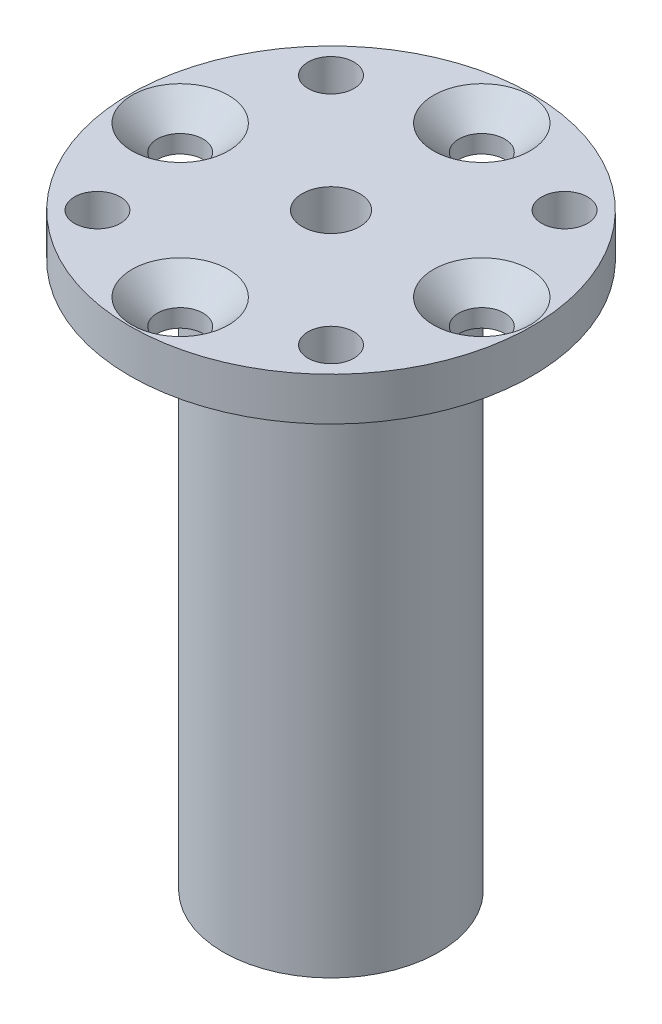
ISO-10303-21;
HEADER;
FILE_DESCRIPTION(('STEP AP214'),'2;1');
FILE_NAME('part.step','',(''),(''),'','','');
FILE_SCHEMA(('AUTOMOTIVE_DESIGN { 1 0 10303 214 1 1 1 1 }'));
ENDSEC;
DATA;
#1=APPLICATION_CONTEXT('core data for automotive mechanical design processes');
#2=APPLICATION_PROTOCOL_DEFINITION('international standard','automotive_design',2000,#1);
#3=PRODUCT_CONTEXT('',#1,'mechanical');
#4=PRODUCT('Part','Part','',(#3));
#5=PRODUCT_RELATED_PRODUCT_CATEGORY('part','',(#4));
#6=PRODUCT_DEFINITION_FORMATION('','',#4);
#7=PRODUCT_DEFINITION_CONTEXT('part definition',#1,'design');
#8=PRODUCT_DEFINITION('design','',#6,#7);
#9=PRODUCT_DEFINITION_SHAPE('','',#8);
#10=(LENGTH_UNIT() NAMED_UNIT(*) SI_UNIT(.MILLI.,.METRE.));
#11=(NAMED_UNIT(*) PLANE_ANGLE_UNIT() SI_UNIT($,.RADIAN.));
#12=(NAMED_UNIT(*) SI_UNIT($,.STERADIAN.) SOLID_ANGLE_UNIT());
#13=UNCERTAINTY_MEASURE_WITH_UNIT(LENGTH_MEASURE(1.E-05),#10,'distance_accuracy_value','');
#14=(GEOMETRIC_REPRESENTATION_CONTEXT(3) GLOBAL_UNCERTAINTY_ASSIGNED_CONTEXT((#13)) GLOBAL_UNIT_ASSIGNED_CONTEXT((#10,
#11,#12)) REPRESENTATION_CONTEXT('',''));
#15=CARTESIAN_POINT('',(0.,0.,0.));
#16=DIRECTION('',(0.,0.,1.));
#17=DIRECTION('',(1.,0.,0.));
#18=AXIS2_PLACEMENT_3D('',#15,#16,#17);
#19=CARTESIAN_POINT('',(0.,0.,0.));
#20=DIRECTION('',(0.,-1.,0.));
#21=DIRECTION('',(0.,0.,-1.));
#22=AXIS2_PLACEMENT_3D('',#19,#20,#21);
#23=PLANE('',#22);
#24=CARTESIAN_POINT('',(8.13172798364517,0.,-8.13172798364543));
#25=DIRECTION('',(0.,1.,0.));
#26=DIRECTION('',(0.,0.,1.));
#27=AXIS2_PLACEMENT_3D('',#24,#25,#26);
#28=CIRCLE('',#27,1.6);
#29=CARTESIAN_POINT('',(8.13172798364517,0.,-6.53172798364543));
#30=VERTEX_POINT('',#29);
#31=EDGE_CURVE('E145',#30,#30,#28,.T.);
#32=ORIENTED_EDGE('',*,*,#31,.F.);
#33=EDGE_LOOP('',(#32));
#34=FACE_BOUND('',#33,.T.);
#35=CARTESIAN_POINT('',(8.13172798364534,0.,8.13172798364525));
#36=DIRECTION('',(0.,1.,0.));
#37=DIRECTION('',(0.,0.,1.));
#38=AXIS2_PLACEMENT_3D('',#35,#36,#37);
#39=CIRCLE('',#38,1.6);
#40=CARTESIAN_POINT('',(8.13172798364534,0.,9.73172798364525));
#41=VERTEX_POINT('',#40);
#42=EDGE_CURVE('E149',#41,#41,#39,.T.);
#43=ORIENTED_EDGE('',*,*,#42,.F.);
#44=EDGE_LOOP('',(#43));
#45=FACE_BOUND('',#44,.T.);
#46=CARTESIAN_POINT('',(-8.13172798364534,0.,-8.13172798364525));
#47=DIRECTION('',(0.,1.,0.));
#48=DIRECTION('',(0.,0.,1.));
#49=AXIS2_PLACEMENT_3D('',#46,#47,#48);
#50=CIRCLE('',#49,1.6);
#51=CARTESIAN_POINT('',(-8.13172798364534,0.,-6.53172798364525));
#52=VERTEX_POINT('',#51);
#53=EDGE_CURVE('E153',#52,#52,#50,.T.);
#54=ORIENTED_EDGE('',*,*,#53,.F.);
#55=EDGE_LOOP('',(#54));
#56=FACE_BOUND('',#55,.T.);
#57=CARTESIAN_POINT('',(10.5,0.,-1.09981662173559E-13));
#58=DIRECTION('',(0.,1.,0.));
#59=DIRECTION('',(0.,0.,1.));
#60=AXIS2_PLACEMENT_3D('',#57,#58,#59);
#61=CIRCLE('',#60,3.36);
#62=CARTESIAN_POINT('',(10.5,0.,3.35999999999989));
#63=VERTEX_POINT('',#62);
#64=EDGE_CURVE('E157',#63,#63,#61,.T.);
#65=ORIENTED_EDGE('',*,*,#64,.F.);
#66=EDGE_LOOP('',(#65));
#67=FACE_BOUND('',#66,.T.);
#68=CARTESIAN_POINT('',(0.,0.,10.5));
#69=DIRECTION('',(0.,1.,0.));
#70=DIRECTION('',(0.,0.,1.));
#71=AXIS2_PLACEMENT_3D('',#68,#69,#70);
#72=CIRCLE('',#71,3.36);
#73=CARTESIAN_POINT('',(0.,0.,13.86));
#74=VERTEX_POINT('',#73);
#75=EDGE_CURVE('E161',#74,#74,#72,.T.);
#76=ORIENTED_EDGE('',*,*,#75,.F.);
#77=EDGE_LOOP('',(#76));
#78=FACE_BOUND('',#77,.T.);
#79=CARTESIAN_POINT('',(-10.5,0.,0.));
#80=DIRECTION('',(0.,1.,0.));
#81=DIRECTION('',(0.,0.,1.));
#82=AXIS2_PLACEMENT_3D('',#79,#80,#81);
#83=CIRCLE('',#82,3.36);
#84=CARTESIAN_POINT('',(-10.5,0.,3.36000000000004));
#85=VERTEX_POINT('',#84);
#86=EDGE_CURVE('E165',#85,#85,#83,.T.);
#87=ORIENTED_EDGE('',*,*,#86,.F.);
#88=EDGE_LOOP('',(#87));
#89=FACE_BOUND('',#88,.T.);
#90=CARTESIAN_POINT('',(0.,0.,-10.5));
#91=DIRECTION('',(0.,1.,0.));
#92=DIRECTION('',(0.,0.,1.));
#93=AXIS2_PLACEMENT_3D('',#90,#91,#92);
#94=CIRCLE('',#93,3.36);
#95=CARTESIAN_POINT('',(0.,0.,-7.14));
#96=VERTEX_POINT('',#95);
#97=EDGE_CURVE('E169',#96,#96,#94,.T.);
#98=ORIENTED_EDGE('',*,*,#97,.F.);
#99=EDGE_LOOP('',(#98));
#100=FACE_BOUND('',#99,.T.);
#101=CARTESIAN_POINT('',(0.,0.,0.));
#102=DIRECTION('',(0.,1.,0.));
#103=DIRECTION('',(0.,0.,1.));
#104=AXIS2_PLACEMENT_3D('',#101,#102,#103);
#105=CIRCLE('',#104,1.99999999999999);
#106=CARTESIAN_POINT('',(0.,0.,1.99999999999999));
#107=VERTEX_POINT('',#106);
#108=EDGE_CURVE('E94',#107,#107,#105,.T.);
#109=ORIENTED_EDGE('',*,*,#108,.F.);
#110=EDGE_LOOP('',(#109));
#111=FACE_BOUND('',#110,.T.);
#112=CARTESIAN_POINT('',(0.,0.,0.));
#113=DIRECTION('',(0.,1.,0.));
#114=DIRECTION('',(0.,0.,1.));
#115=AXIS2_PLACEMENT_3D('',#112,#113,#114);
#116=CIRCLE('',#115,14.);
#117=CARTESIAN_POINT('',(0.,0.,14.));
#118=VERTEX_POINT('',#117);
#119=EDGE_CURVE('E13',#118,#118,#116,.T.);
#120=ORIENTED_EDGE('',*,*,#119,.T.);
#121=EDGE_LOOP('',(#120));
#122=FACE_BOUND('',#121,.T.);
#123=CARTESIAN_POINT('',(-8.13172798364522,0.,8.13172798364537));
#124=DIRECTION('',(0.,1.,0.));
#125=DIRECTION('',(0.,0.,1.));
#126=AXIS2_PLACEMENT_3D('',#123,#124,#125);
#127=CIRCLE('',#126,1.6);
#128=CARTESIAN_POINT('',(-8.13172798364522,0.,9.73172798364537));
#129=VERTEX_POINT('',#128);
#130=EDGE_CURVE('E176',#129,#129,#127,.T.);
#131=ORIENTED_EDGE('',*,*,#130,.F.);
#132=EDGE_LOOP('',(#131));
#133=FACE_BOUND('',#132,.T.);
#134=ADVANCED_FACE('F48',(#34,#45,#56,#67,#78,#89,#100,#111,#122,#133),#23,.F.);
#135=CARTESIAN_POINT('',(0.,9.41489361702128,0.));
#136=DIRECTION('',(0.,1.,0.));
#137=DIRECTION('',(0.,0.,1.));
#138=AXIS2_PLACEMENT_3D('',#135,#136,#137);
#139=CYLINDRICAL_SURFACE('',#138,14.);
#140=ORIENTED_EDGE('',*,*,#119,.F.);
#141=EDGE_LOOP('',(#140));
#142=FACE_BOUND('',#141,.T.);
#143=CARTESIAN_POINT('',(0.,-3.,0.));
#144=DIRECTION('',(0.,1.,0.));
#145=DIRECTION('',(0.,0.,1.));
#146=AXIS2_PLACEMENT_3D('',#143,#144,#145);
#147=CIRCLE('',#146,14.);
#148=CARTESIAN_POINT('',(0.,-3.,14.));
#149=VERTEX_POINT('',#148);
#150=EDGE_CURVE('E55',#149,#149,#147,.T.);
#151=ORIENTED_EDGE('',*,*,#150,.T.);
#152=EDGE_LOOP('',(#151));
#153=FACE_BOUND('',#152,.T.);
#154=ADVANCED_FACE('F108',(#142,#153),#139,.T.);
#155=CARTESIAN_POINT('',(14.,-3.,0.));
#156=DIRECTION('',(0.,1.,0.));
#157=DIRECTION('',(0.,0.,1.));
#158=AXIS2_PLACEMENT_3D('',#155,#156,#157);
#159=PLANE('',#158);
#160=CARTESIAN_POINT('',(8.13172798364517,-3.,-8.13172798364543));
#161=DIRECTION('',(0.,1.,0.));
#162=DIRECTION('',(0.,0.,1.));
#163=AXIS2_PLACEMENT_3D('',#160,#161,#162);
#164=CIRCLE('',#163,1.6);
#165=CARTESIAN_POINT('',(8.13172798364517,-3.,-6.53172798364543));
#166=VERTEX_POINT('',#165);
#167=EDGE_CURVE('E430',#166,#166,#164,.T.);
#168=ORIENTED_EDGE('',*,*,#167,.T.);
#169=EDGE_LOOP('',(#168));
#170=FACE_BOUND('',#169,.T.);
#171=CARTESIAN_POINT('',(8.13172798364534,-3.,8.13172798364525));
#172=DIRECTION('',(0.,1.,0.));
#173=DIRECTION('',(0.,0.,1.));
#174=AXIS2_PLACEMENT_3D('',#171,#172,#173);
#175=CIRCLE('',#174,1.6);
#176=CARTESIAN_POINT('',(8.13172798364534,-3.,9.73172798364525));
#177=VERTEX_POINT('',#176);
#178=EDGE_CURVE('E179',#177,#177,#175,.T.);
#179=ORIENTED_EDGE('',*,*,#178,.T.);
#180=EDGE_LOOP('',(#179));
#181=FACE_BOUND('',#180,.T.);
#182=CARTESIAN_POINT('',(-8.13172798364522,-3.,8.13172798364537));
#183=DIRECTION('',(0.,1.,0.));
#184=DIRECTION('',(0.,0.,1.));
#185=AXIS2_PLACEMENT_3D('',#182,#183,#184);
#186=CIRCLE('',#185,1.6);
#187=CARTESIAN_POINT('',(-8.13172798364522,-3.,9.73172798364537));
#188=VERTEX_POINT('',#187);
#189=EDGE_CURVE('E178',#188,#188,#186,.T.);
#190=ORIENTED_EDGE('',*,*,#189,.T.);
#191=EDGE_LOOP('',(#190));
#192=FACE_BOUND('',#191,.T.);
#193=CARTESIAN_POINT('',(-8.13172798364534,-3.,-8.13172798364525));
#194=DIRECTION('',(0.,1.,0.));
#195=DIRECTION('',(0.,0.,1.));
#196=AXIS2_PLACEMENT_3D('',#193,#194,#195);
#197=CIRCLE('',#196,1.6);
#198=CARTESIAN_POINT('',(-8.13172798364534,-3.,-6.53172798364525));
#199=VERTEX_POINT('',#198);
#200=EDGE_CURVE('E188',#199,#199,#197,.T.);
#201=ORIENTED_EDGE('',*,*,#200,.T.);
#202=EDGE_LOOP('',(#201));
#203=FACE_BOUND('',#202,.T.);
#204=CARTESIAN_POINT('',(10.5,-3.,-1.09981662173559E-13));
#205=DIRECTION('',(0.,1.,0.));
#206=DIRECTION('',(0.,0.,1.));
#207=AXIS2_PLACEMENT_3D('',#204,#205,#206);
#208=CIRCLE('',#207,1.6);
#209=CARTESIAN_POINT('',(10.5,-3.,1.59999999999989));
#210=VERTEX_POINT('',#209);
#211=EDGE_CURVE('E195',#210,#210,#208,.T.);
#212=ORIENTED_EDGE('',*,*,#211,.T.);
#213=EDGE_LOOP('',(#212));
#214=FACE_BOUND('',#213,.T.);
#215=CARTESIAN_POINT('',(0.,-3.,10.5));
#216=DIRECTION('',(0.,1.,0.));
#217=DIRECTION('',(0.,0.,1.));
#218=AXIS2_PLACEMENT_3D('',#215,#216,#217);
#219=CIRCLE('',#218,1.6);
#220=CARTESIAN_POINT('',(0.,-3.,12.1));
#221=VERTEX_POINT('',#220);
#222=EDGE_CURVE('E202',#221,#221,#219,.T.);
#223=ORIENTED_EDGE('',*,*,#222,.T.);
#224=EDGE_LOOP('',(#223));
#225=FACE_BOUND('',#224,.T.);
#226=CARTESIAN_POINT('',(-10.5,-3.,0.));
#227=DIRECTION('',(0.,1.,0.));
#228=DIRECTION('',(0.,0.,1.));
#229=AXIS2_PLACEMENT_3D('',#226,#227,#228);
#230=CIRCLE('',#229,1.6);
#231=CARTESIAN_POINT('',(-10.5,-3.,1.60000000000003));
#232=VERTEX_POINT('',#231);
#233=EDGE_CURVE('E209',#232,#232,#230,.T.);
#234=ORIENTED_EDGE('',*,*,#233,.T.);
#235=EDGE_LOOP('',(#234));
#236=FACE_BOUND('',#235,.T.);
#237=CARTESIAN_POINT('',(0.,-3.,-10.5));
#238=DIRECTION('',(0.,1.,0.));
#239=DIRECTION('',(0.,0.,1.));
#240=AXIS2_PLACEMENT_3D('',#237,#238,#239);
#241=CIRCLE('',#240,1.6);
#242=CARTESIAN_POINT('',(0.,-3.,-8.9));
#243=VERTEX_POINT('',#242);
#244=EDGE_CURVE('E82',#243,#243,#241,.T.);
#245=ORIENTED_EDGE('',*,*,#244,.T.);
#246=EDGE_LOOP('',(#245));
#247=FACE_BOUND('',#246,.T.);
#248=ORIENTED_EDGE('',*,*,#150,.F.);
#249=EDGE_LOOP('',(#248));
#250=FACE_BOUND('',#249,.T.);
#251=CARTESIAN_POINT('',(0.,-3.,0.));
#252=DIRECTION('',(0.,1.,0.));
#253=DIRECTION('',(0.,0.,1.));
#254=AXIS2_PLACEMENT_3D('',#251,#252,#253);
#255=CIRCLE('',#254,7.5);
#256=CARTESIAN_POINT('',(0.,-3.,7.5));
#257=VERTEX_POINT('',#256);
#258=EDGE_CURVE('E103',#257,#257,#255,.T.);
#259=ORIENTED_EDGE('',*,*,#258,.T.);
#260=EDGE_LOOP('',(#259));
#261=FACE_BOUND('',#260,.T.);
#262=ADVANCED_FACE('F110',(#170,#181,#192,#203,#214,#225,#236,#247,#250,#261),#159,.F.);
#263=CARTESIAN_POINT('',(0.,9.41489361702128,0.));
#264=DIRECTION('',(0.,1.,0.));
#265=DIRECTION('',(0.,0.,1.));
#266=AXIS2_PLACEMENT_3D('',#263,#264,#265);
#267=CYLINDRICAL_SURFACE('',#266,7.5);
#268=ORIENTED_EDGE('',*,*,#258,.F.);
#269=EDGE_LOOP('',(#268));
#270=FACE_BOUND('',#269,.T.);
#271=CARTESIAN_POINT('',(0.,-41.,0.));
#272=DIRECTION('',(0.,1.,0.));
#273=DIRECTION('',(0.,0.,1.));
#274=AXIS2_PLACEMENT_3D('',#271,#272,#273);
#275=CIRCLE('',#274,7.50000000000001);
#276=CARTESIAN_POINT('',(0.,-41.,7.50000000000001));
#277=VERTEX_POINT('',#276);
#278=EDGE_CURVE('E100',#277,#277,#275,.T.);
#279=ORIENTED_EDGE('',*,*,#278,.T.);
#280=EDGE_LOOP('',(#279));
#281=FACE_BOUND('',#280,.T.);
#282=ADVANCED_FACE('F113',(#270,#281),#267,.T.);
#283=CARTESIAN_POINT('',(7.50000000000001,-41.,0.));
#284=DIRECTION('',(0.,1.,0.));
#285=DIRECTION('',(0.,0.,1.));
#286=AXIS2_PLACEMENT_3D('',#283,#284,#285);
#287=PLANE('',#286);
#288=CARTESIAN_POINT('',(-2.74999999999996,-41.,4.76313972081444));
#289=DIRECTION('',(0.,-1.,0.));
#290=DIRECTION('',(0.,0.,-1.));
#291=AXIS2_PLACEMENT_3D('',#288,#289,#290);
#292=CIRCLE('',#291,1.24999999999999);
#293=CARTESIAN_POINT('',(-2.74999999999996,-41.,3.51313972081445));
#294=VERTEX_POINT('',#293);
#295=EDGE_CURVE('E76',#294,#294,#292,.T.);
#296=ORIENTED_EDGE('',*,*,#295,.F.);
#297=EDGE_LOOP('',(#296));
#298=FACE_BOUND('',#297,.T.);
#299=CARTESIAN_POINT('',(-2.75000000000002,-41.,-4.7631397208144));
#300=DIRECTION('',(0.,-1.,0.));
#301=DIRECTION('',(0.,0.,-1.));
#302=AXIS2_PLACEMENT_3D('',#299,#300,#301);
#303=CIRCLE('',#302,1.24999999999999);
#304=CARTESIAN_POINT('',(-2.75000000000002,-41.,-6.01313972081439));
#305=VERTEX_POINT('',#304);
#306=EDGE_CURVE('E75',#305,#305,#303,.T.);
#307=ORIENTED_EDGE('',*,*,#306,.F.);
#308=EDGE_LOOP('',(#307));
#309=FACE_BOUND('',#308,.T.);
#310=CARTESIAN_POINT('',(5.5,-41.,0.));
#311=DIRECTION('',(0.,-1.,0.));
#312=DIRECTION('',(0.,0.,-1.));
#313=AXIS2_PLACEMENT_3D('',#310,#311,#312);
#314=CIRCLE('',#313,1.24999999999999);
#315=CARTESIAN_POINT('',(5.5,-41.,-1.24999999999999));
#316=VERTEX_POINT('',#315);
#317=EDGE_CURVE('E88',#316,#316,#314,.T.);
#318=ORIENTED_EDGE('',*,*,#317,.F.);
#319=EDGE_LOOP('',(#318));
#320=FACE_BOUND('',#319,.T.);
#321=CARTESIAN_POINT('',(0.,-41.,0.));
#322=DIRECTION('',(0.,1.,0.));
#323=DIRECTION('',(0.,0.,1.));
#324=AXIS2_PLACEMENT_3D('',#321,#322,#323);
#325=CIRCLE('',#324,1.99999999999999);
#326=CARTESIAN_POINT('',(0.,-41.,1.99999999999999));
#327=VERTEX_POINT('',#326);
#328=EDGE_CURVE('E97',#327,#327,#325,.T.);
#329=ORIENTED_EDGE('',*,*,#328,.T.);
#330=EDGE_LOOP('',(#329));
#331=FACE_BOUND('',#330,.T.);
#332=ORIENTED_EDGE('',*,*,#278,.F.);
#333=EDGE_LOOP('',(#332));
#334=FACE_BOUND('',#333,.T.);
#335=ADVANCED_FACE('F120',(#298,#309,#320,#331,#334),#287,.F.);
#336=CARTESIAN_POINT('',(0.,0.,0.));
#337=DIRECTION('',(0.,1.,0.));
#338=DIRECTION('',(0.,0.,1.));
#339=AXIS2_PLACEMENT_3D('',#336,#337,#338);
#340=CYLINDRICAL_SURFACE('',#339,1.99999999999999);
#341=ORIENTED_EDGE('',*,*,#328,.F.);
#342=EDGE_LOOP('',(#341));
#343=FACE_BOUND('',#342,.T.);
#344=ORIENTED_EDGE('',*,*,#108,.T.);
#345=EDGE_LOOP('',(#344));
#346=FACE_BOUND('',#345,.T.);
#347=ADVANCED_FACE('F125',(#343,#346),#340,.F.);
#348=CARTESIAN_POINT('',(5.5,-29.,0.));
#349=DIRECTION('',(0.,-1.,0.));
#350=DIRECTION('',(0.,0.,-1.));
#351=AXIS2_PLACEMENT_3D('',#348,#349,#350);
#352=CONICAL_SURFACE('',#351,1.24999999999999,1.02974425867665);
#353=CARTESIAN_POINT('',(5.5,-28.2489242262156,0.));
#354=VERTEX_POINT('',#353);
#355=VERTEX_LOOP('',#354);
#356=FACE_BOUND('',#355,.T.);
#357=CARTESIAN_POINT('',(5.5,-29.,0.));
#358=DIRECTION('',(0.,-1.,0.));
#359=DIRECTION('',(0.,0.,-1.));
#360=AXIS2_PLACEMENT_3D('',#357,#358,#359);
#361=CIRCLE('',#360,1.24999999999999);
#362=CARTESIAN_POINT('',(5.5,-29.,-1.24999999999999));
#363=VERTEX_POINT('',#362);
#364=EDGE_CURVE('E91',#363,#363,#361,.T.);
#365=ORIENTED_EDGE('',*,*,#364,.T.);
#366=EDGE_LOOP('',(#365));
#367=FACE_BOUND('',#366,.T.);
#368=ADVANCED_FACE('F131',(#356,#367),#352,.F.);
#369=CARTESIAN_POINT('',(5.5,-41.,0.));
#370=DIRECTION('',(0.,-1.,0.));
#371=DIRECTION('',(0.,0.,-1.));
#372=AXIS2_PLACEMENT_3D('',#369,#370,#371);
#373=CYLINDRICAL_SURFACE('',#372,1.24999999999999);
#374=ORIENTED_EDGE('',*,*,#364,.F.);
#375=EDGE_LOOP('',(#374));
#376=FACE_BOUND('',#375,.T.);
#377=ORIENTED_EDGE('',*,*,#317,.T.);
#378=EDGE_LOOP('',(#377));
#379=FACE_BOUND('',#378,.T.);
#380=ADVANCED_FACE('F246',(#376,#379),#373,.F.);
#381=CARTESIAN_POINT('',(-2.75000000000002,-29.,-4.7631397208144));
#382=DIRECTION('',(0.,-1.,0.));
#383=DIRECTION('',(0.,0.,-1.));
#384=AXIS2_PLACEMENT_3D('',#381,#382,#383);
#385=CONICAL_SURFACE('',#384,1.24999999999999,1.02974425867665);
#386=CARTESIAN_POINT('',(-2.75000000000003,-28.2489242262156,-4.7631397208144));
#387=VERTEX_POINT('',#386);
#388=VERTEX_LOOP('',#387);
#389=FACE_BOUND('',#388,.T.);
#390=CARTESIAN_POINT('',(-2.75000000000002,-29.,-4.7631397208144));
#391=DIRECTION('',(0.,-1.,0.));
#392=DIRECTION('',(0.,0.,-1.));
#393=AXIS2_PLACEMENT_3D('',#390,#391,#392);
#394=CIRCLE('',#393,1.24999999999999);
#395=CARTESIAN_POINT('',(-2.75000000000002,-29.,-6.01313972081439));
#396=VERTEX_POINT('',#395);
#397=EDGE_CURVE('E79',#396,#396,#394,.T.);
#398=ORIENTED_EDGE('',*,*,#397,.T.);
#399=EDGE_LOOP('',(#398));
#400=FACE_BOUND('',#399,.T.);
#401=ADVANCED_FACE('F242',(#389,#400),#385,.F.);
#402=CARTESIAN_POINT('',(-2.75000000000002,-41.,-4.7631397208144));
#403=DIRECTION('',(0.,-1.,0.));
#404=DIRECTION('',(0.,0.,-1.));
#405=AXIS2_PLACEMENT_3D('',#402,#403,#404);
#406=CYLINDRICAL_SURFACE('',#405,1.24999999999999);
#407=ORIENTED_EDGE('',*,*,#397,.F.);
#408=EDGE_LOOP('',(#407));
#409=FACE_BOUND('',#408,.T.);
#410=ORIENTED_EDGE('',*,*,#306,.T.);
#411=EDGE_LOOP('',(#410));
#412=FACE_BOUND('',#411,.T.);
#413=ADVANCED_FACE('F69',(#409,#412),#406,.F.);
#414=CARTESIAN_POINT('',(-2.74999999999996,-29.,4.76313972081444));
#415=DIRECTION('',(0.,-1.,0.));
#416=DIRECTION('',(0.,0.,-1.));
#417=AXIS2_PLACEMENT_3D('',#414,#415,#416);
#418=CONICAL_SURFACE('',#417,1.24999999999999,1.02974425867665);
#419=CARTESIAN_POINT('',(-2.74999999999996,-28.2489242262156,4.76313972081444));
#420=VERTEX_POINT('',#419);
#421=VERTEX_LOOP('',#420);
#422=FACE_BOUND('',#421,.T.);
#423=CARTESIAN_POINT('',(-2.74999999999996,-29.,4.76313972081444));
#424=DIRECTION('',(0.,-1.,0.));
#425=DIRECTION('',(0.,0.,-1.));
#426=AXIS2_PLACEMENT_3D('',#423,#424,#425);
#427=CIRCLE('',#426,1.24999999999999);
#428=CARTESIAN_POINT('',(-2.74999999999996,-29.,3.51313972081445));
#429=VERTEX_POINT('',#428);
#430=EDGE_CURVE('E73',#429,#429,#427,.T.);
#431=ORIENTED_EDGE('',*,*,#430,.T.);
#432=EDGE_LOOP('',(#431));
#433=FACE_BOUND('',#432,.T.);
#434=ADVANCED_FACE('F65',(#422,#433),#418,.F.);
#435=CARTESIAN_POINT('',(-2.74999999999996,-41.,4.76313972081444));
#436=DIRECTION('',(0.,-1.,0.));
#437=DIRECTION('',(0.,0.,-1.));
#438=AXIS2_PLACEMENT_3D('',#435,#436,#437);
#439=CYLINDRICAL_SURFACE('',#438,1.24999999999999);
#440=ORIENTED_EDGE('',*,*,#430,.F.);
#441=EDGE_LOOP('',(#440));
#442=FACE_BOUND('',#441,.T.);
#443=ORIENTED_EDGE('',*,*,#295,.T.);
#444=EDGE_LOOP('',(#443));
#445=FACE_BOUND('',#444,.T.);
#446=ADVANCED_FACE('F68',(#442,#445),#439,.F.);
#447=CARTESIAN_POINT('',(0.,0.,-10.5));
#448=DIRECTION('',(0.,1.,0.));
#449=DIRECTION('',(0.,0.,1.));
#450=AXIS2_PLACEMENT_3D('',#447,#448,#449);
#451=CYLINDRICAL_SURFACE('',#450,1.6);
#452=ORIENTED_EDGE('',*,*,#244,.F.);
#453=EDGE_LOOP('',(#452));
#454=FACE_BOUND('',#453,.T.);
#455=CARTESIAN_POINT('',(0.,-1.76,-10.5));
#456=DIRECTION('',(0.,1.,0.));
#457=DIRECTION('',(0.,0.,1.));
#458=AXIS2_PLACEMENT_3D('',#455,#456,#457);
#459=CIRCLE('',#458,1.59999999999999);
#460=CARTESIAN_POINT('',(0.,-1.76,-8.90000000000001));
#461=VERTEX_POINT('',#460);
#462=EDGE_CURVE('E213',#461,#461,#459,.T.);
#463=ORIENTED_EDGE('',*,*,#462,.T.);
#464=EDGE_LOOP('',(#463));
#465=FACE_BOUND('',#464,.T.);
#466=ADVANCED_FACE('F219',(#454,#465),#451,.F.);
#467=CARTESIAN_POINT('',(0.,0.,-10.5));
#468=DIRECTION('',(0.,1.,0.));
#469=DIRECTION('',(0.,0.,1.));
#470=AXIS2_PLACEMENT_3D('',#467,#468,#469);
#471=CONICAL_SURFACE('',#470,3.36,0.785398163397449);
#472=ORIENTED_EDGE('',*,*,#462,.F.);
#473=EDGE_LOOP('',(#472));
#474=FACE_BOUND('',#473,.T.);
#475=ORIENTED_EDGE('',*,*,#97,.T.);
#476=EDGE_LOOP('',(#475));
#477=FACE_BOUND('',#476,.T.);
#478=ADVANCED_FACE('F222',(#474,#477),#471,.F.);
#479=CARTESIAN_POINT('',(-10.5,0.,0.));
#480=DIRECTION('',(0.,1.,0.));
#481=DIRECTION('',(0.,0.,1.));
#482=AXIS2_PLACEMENT_3D('',#479,#480,#481);
#483=CYLINDRICAL_SURFACE('',#482,1.6);
#484=ORIENTED_EDGE('',*,*,#233,.F.);
#485=EDGE_LOOP('',(#484));
#486=FACE_BOUND('',#485,.T.);
#487=CARTESIAN_POINT('',(-10.5,-1.76,0.));
#488=DIRECTION('',(0.,1.,0.));
#489=DIRECTION('',(0.,0.,1.));
#490=AXIS2_PLACEMENT_3D('',#487,#488,#489);
#491=CIRCLE('',#490,1.6);
#492=CARTESIAN_POINT('',(-10.5,-1.76,1.60000000000003));
#493=VERTEX_POINT('',#492);
#494=EDGE_CURVE('E206',#493,#493,#491,.T.);
#495=ORIENTED_EDGE('',*,*,#494,.T.);
#496=EDGE_LOOP('',(#495));
#497=FACE_BOUND('',#496,.T.);
#498=ADVANCED_FACE('F228',(#486,#497),#483,.F.);
#499=CARTESIAN_POINT('',(-10.5,0.,0.));
#500=DIRECTION('',(0.,1.,0.));
#501=DIRECTION('',(0.,0.,1.));
#502=AXIS2_PLACEMENT_3D('',#499,#500,#501);
#503=CONICAL_SURFACE('',#502,3.36,0.785398163397448);
#504=ORIENTED_EDGE('',*,*,#494,.F.);
#505=EDGE_LOOP('',(#504));
#506=FACE_BOUND('',#505,.T.);
#507=ORIENTED_EDGE('',*,*,#86,.T.);
#508=EDGE_LOOP('',(#507));
#509=FACE_BOUND('',#508,.T.);
#510=ADVANCED_FACE('F233',(#506,#509),#503,.F.);
#511=CARTESIAN_POINT('',(0.,0.,10.5));
#512=DIRECTION('',(0.,1.,0.));
#513=DIRECTION('',(0.,0.,1.));
#514=AXIS2_PLACEMENT_3D('',#511,#512,#513);
#515=CYLINDRICAL_SURFACE('',#514,1.6);
#516=ORIENTED_EDGE('',*,*,#222,.F.);
#517=EDGE_LOOP('',(#516));
#518=FACE_BOUND('',#517,.T.);
#519=CARTESIAN_POINT('',(0.,-1.76,10.5));
#520=DIRECTION('',(0.,1.,0.));
#521=DIRECTION('',(0.,0.,1.));
#522=AXIS2_PLACEMENT_3D('',#519,#520,#521);
#523=CIRCLE('',#522,1.59999999999999);
#524=CARTESIAN_POINT('',(0.,-1.76,12.1));
#525=VERTEX_POINT('',#524);
#526=EDGE_CURVE('E199',#525,#525,#523,.T.);
#527=ORIENTED_EDGE('',*,*,#526,.T.);
#528=EDGE_LOOP('',(#527));
#529=FACE_BOUND('',#528,.T.);
#530=ADVANCED_FACE('F317',(#518,#529),#515,.F.);
#531=CARTESIAN_POINT('',(0.,0.,10.5));
#532=DIRECTION('',(0.,1.,0.));
#533=DIRECTION('',(0.,0.,1.));
#534=AXIS2_PLACEMENT_3D('',#531,#532,#533);
#535=CONICAL_SURFACE('',#534,3.36,0.785398163397449);
#536=ORIENTED_EDGE('',*,*,#526,.F.);
#537=EDGE_LOOP('',(#536));
#538=FACE_BOUND('',#537,.T.);
#539=ORIENTED_EDGE('',*,*,#75,.T.);
#540=EDGE_LOOP('',(#539));
#541=FACE_BOUND('',#540,.T.);
#542=ADVANCED_FACE('F327',(#538,#541),#535,.F.);
#543=CARTESIAN_POINT('',(10.5,0.,-1.09981662173559E-13));
#544=DIRECTION('',(0.,1.,0.));
#545=DIRECTION('',(0.,0.,1.));
#546=AXIS2_PLACEMENT_3D('',#543,#544,#545);
#547=CYLINDRICAL_SURFACE('',#546,1.6);
#548=ORIENTED_EDGE('',*,*,#211,.F.);
#549=EDGE_LOOP('',(#548));
#550=FACE_BOUND('',#549,.T.);
#551=CARTESIAN_POINT('',(10.5,-1.76,-1.09981662173559E-13));
#552=DIRECTION('',(0.,1.,0.));
#553=DIRECTION('',(0.,0.,1.));
#554=AXIS2_PLACEMENT_3D('',#551,#552,#553);
#555=CIRCLE('',#554,1.6);
#556=CARTESIAN_POINT('',(10.5,-1.76,1.59999999999989));
#557=VERTEX_POINT('',#556);
#558=EDGE_CURVE('E192',#557,#557,#555,.T.);
#559=ORIENTED_EDGE('',*,*,#558,.T.);
#560=EDGE_LOOP('',(#559));
#561=FACE_BOUND('',#560,.T.);
#562=ADVANCED_FACE('F339',(#550,#561),#547,.F.);
#563=CARTESIAN_POINT('',(10.5,0.,-1.09981662173559E-13));
#564=DIRECTION('',(0.,1.,0.));
#565=DIRECTION('',(0.,0.,1.));
#566=AXIS2_PLACEMENT_3D('',#563,#564,#565);
#567=CONICAL_SURFACE('',#566,3.36,0.785398163397448);
#568=ORIENTED_EDGE('',*,*,#558,.F.);
#569=EDGE_LOOP('',(#568));
#570=FACE_BOUND('',#569,.T.);
#571=ORIENTED_EDGE('',*,*,#64,.T.);
#572=EDGE_LOOP('',(#571));
#573=FACE_BOUND('',#572,.T.);
#574=ADVANCED_FACE('F350',(#570,#573),#567,.F.);
#575=CARTESIAN_POINT('',(-8.13172798364534,0.,-8.13172798364525));
#576=DIRECTION('',(0.,1.,0.));
#577=DIRECTION('',(0.,0.,1.));
#578=AXIS2_PLACEMENT_3D('',#575,#576,#577);
#579=CYLINDRICAL_SURFACE('',#578,1.6);
#580=ORIENTED_EDGE('',*,*,#200,.F.);
#581=EDGE_LOOP('',(#580));
#582=FACE_BOUND('',#581,.T.);
#583=ORIENTED_EDGE('',*,*,#53,.T.);
#584=EDGE_LOOP('',(#583));
#585=FACE_BOUND('',#584,.T.);
#586=ADVANCED_FACE('F361',(#582,#585),#579,.F.);
#587=CARTESIAN_POINT('',(-8.13172798364522,0.,8.13172798364537));
#588=DIRECTION('',(0.,1.,0.));
#589=DIRECTION('',(0.,0.,1.));
#590=AXIS2_PLACEMENT_3D('',#587,#588,#589);
#591=CYLINDRICAL_SURFACE('',#590,1.6);
#592=ORIENTED_EDGE('',*,*,#189,.F.);
#593=EDGE_LOOP('',(#592));
#594=FACE_BOUND('',#593,.T.);
#595=ORIENTED_EDGE('',*,*,#130,.T.);
#596=EDGE_LOOP('',(#595));
#597=FACE_BOUND('',#596,.T.);
#598=ADVANCED_FACE('F370',(#594,#597),#591,.F.);
#599=CARTESIAN_POINT('',(8.13172798364534,0.,8.13172798364525));
#600=DIRECTION('',(0.,1.,0.));
#601=DIRECTION('',(0.,0.,1.));
#602=AXIS2_PLACEMENT_3D('',#599,#600,#601);
#603=CYLINDRICAL_SURFACE('',#602,1.6);
#604=ORIENTED_EDGE('',*,*,#178,.F.);
#605=EDGE_LOOP('',(#604));
#606=FACE_BOUND('',#605,.T.);
#607=ORIENTED_EDGE('',*,*,#42,.T.);
#608=EDGE_LOOP('',(#607));
#609=FACE_BOUND('',#608,.T.);
#610=ADVANCED_FACE('F393',(#606,#609),#603,.F.);
#611=CARTESIAN_POINT('',(8.13172798364517,0.,-8.13172798364543));
#612=DIRECTION('',(0.,1.,0.));
#613=DIRECTION('',(0.,0.,1.));
#614=AXIS2_PLACEMENT_3D('',#611,#612,#613);
#615=CYLINDRICAL_SURFACE('',#614,1.6);
#616=ORIENTED_EDGE('',*,*,#167,.F.);
#617=EDGE_LOOP('',(#616));
#618=FACE_BOUND('',#617,.T.);
#619=ORIENTED_EDGE('',*,*,#31,.T.);
#620=EDGE_LOOP('',(#619));
#621=FACE_BOUND('',#620,.T.);
#622=ADVANCED_FACE('F403',(#618,#621),#615,.F.);
#623=CLOSED_SHELL('',(#134,#154,#262,#282,#335,#347,#368,#380,#401,#413,#434,#446,#466,#478,
#498,#510,#530,#542,#562,#574,#586,#598,#610,#622));
#624=MANIFOLD_SOLID_BREP('B2',#623);
#625=ADVANCED_BREP_SHAPE_REPRESENTATION('',(#18,#624),#14);
#626=SHAPE_DEFINITION_REPRESENTATION(#9,#625);
ENDSEC;
END-ISO-10303-21;
